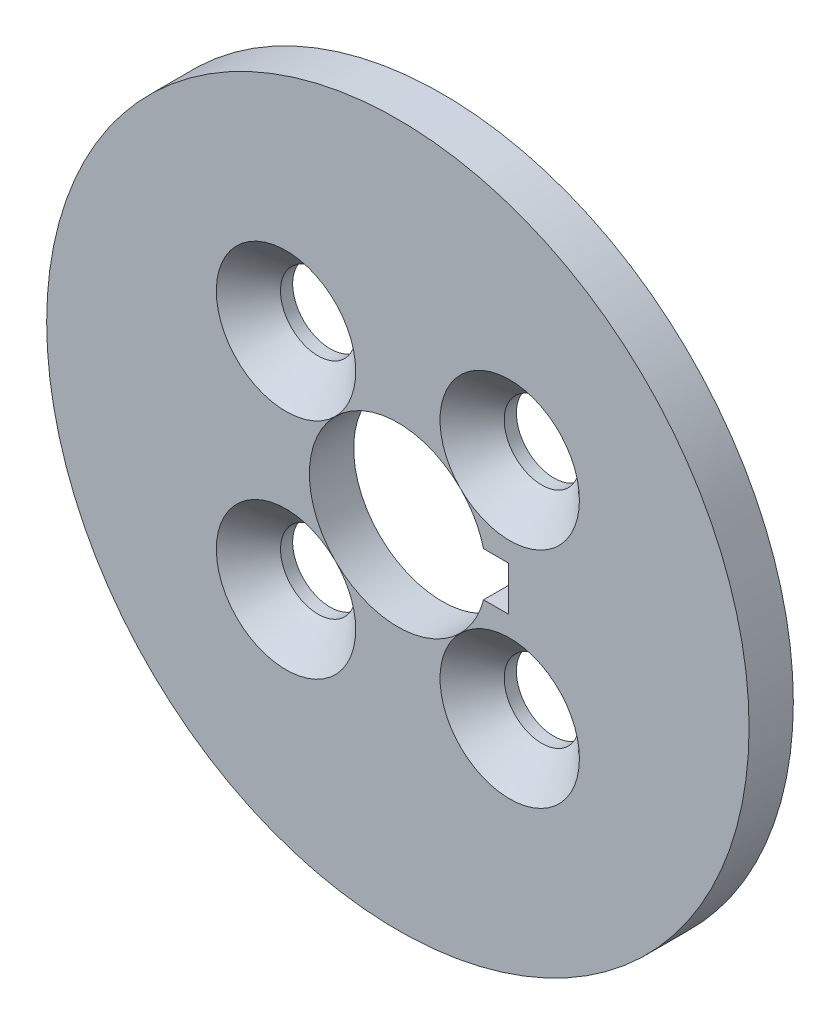
ISO-10303-21;
HEADER;
FILE_DESCRIPTION(('STEP AP214'),'2;1');
FILE_NAME('part.step','',(''),(''),'','','');
FILE_SCHEMA(('AUTOMOTIVE_DESIGN { 1 0 10303 214 1 1 1 1 }'));
ENDSEC;
DATA;
#1=APPLICATION_CONTEXT('core data for automotive mechanical design processes');
#2=APPLICATION_PROTOCOL_DEFINITION('international standard','automotive_design',2000,#1);
#3=PRODUCT_CONTEXT('',#1,'mechanical');
#4=PRODUCT('Part','Part','',(#3));
#5=PRODUCT_RELATED_PRODUCT_CATEGORY('part','',(#4));
#6=PRODUCT_DEFINITION_FORMATION('','',#4);
#7=PRODUCT_DEFINITION_CONTEXT('part definition',#1,'design');
#8=PRODUCT_DEFINITION('design','',#6,#7);
#9=PRODUCT_DEFINITION_SHAPE('','',#8);
#10=(LENGTH_UNIT() NAMED_UNIT(*) SI_UNIT(.MILLI.,.METRE.));
#11=(NAMED_UNIT(*) PLANE_ANGLE_UNIT() SI_UNIT($,.RADIAN.));
#12=(NAMED_UNIT(*) SI_UNIT($,.STERADIAN.) SOLID_ANGLE_UNIT());
#13=UNCERTAINTY_MEASURE_WITH_UNIT(LENGTH_MEASURE(1.E-05),#10,'distance_accuracy_value','');
#14=(GEOMETRIC_REPRESENTATION_CONTEXT(3) GLOBAL_UNCERTAINTY_ASSIGNED_CONTEXT((#13)) GLOBAL_UNIT_ASSIGNED_CONTEXT((#10,
#11,#12)) REPRESENTATION_CONTEXT('',''));
#15=CARTESIAN_POINT('',(0.,0.,0.));
#16=DIRECTION('',(0.,0.,1.));
#17=DIRECTION('',(1.,0.,0.));
#18=AXIS2_PLACEMENT_3D('',#15,#16,#17);
#19=CARTESIAN_POINT('',(-165.662570111801,103.941444968287,2.));
#20=DIRECTION('',(0.,0.,-1.));
#21=DIRECTION('',(-1.,0.,0.));
#22=AXIS2_PLACEMENT_3D('',#19,#20,#21);
#23=CYLINDRICAL_SURFACE('',#22,1.70000000000001);
#24=CARTESIAN_POINT('',(-165.662570111801,103.941444968287,0.));
#25=DIRECTION('',(0.,0.,1.));
#26=DIRECTION('',(1.,0.,0.));
#27=AXIS2_PLACEMENT_3D('',#24,#25,#26);
#28=CIRCLE('',#27,1.70000000000001);
#29=CARTESIAN_POINT('',(-163.962570111801,103.941444968287,0.));
#30=VERTEX_POINT('',#29);
#31=EDGE_CURVE('E154',#30,#30,#28,.T.);
#32=ORIENTED_EDGE('',*,*,#31,.F.);
#33=EDGE_LOOP('',(#32));
#34=FACE_BOUND('',#33,.T.);
#35=CARTESIAN_POINT('',(-165.662570111801,103.941444968287,0.549999999999993));
#36=DIRECTION('',(0.,0.,1.));
#37=DIRECTION('',(1.,0.,0.));
#38=AXIS2_PLACEMENT_3D('',#35,#36,#37);
#39=CIRCLE('',#38,1.69999999999998);
#40=CARTESIAN_POINT('',(-163.962570111801,103.941444968287,0.549999999999993));
#41=VERTEX_POINT('',#40);
#42=EDGE_CURVE('E116',#41,#41,#39,.T.);
#43=ORIENTED_EDGE('',*,*,#42,.T.);
#44=EDGE_LOOP('',(#43));
#45=FACE_BOUND('',#44,.T.);
#46=ADVANCED_FACE('F34',(#34,#45),#23,.F.);
#47=CARTESIAN_POINT('',(-155.550943140833,103.941444968288,2.));
#48=DIRECTION('',(0.,0.,-1.));
#49=DIRECTION('',(-1.,0.,0.));
#50=AXIS2_PLACEMENT_3D('',#47,#48,#49);
#51=CYLINDRICAL_SURFACE('',#50,1.70000000000001);
#52=CARTESIAN_POINT('',(-155.550943140833,103.941444968288,0.));
#53=DIRECTION('',(0.,0.,1.));
#54=DIRECTION('',(1.,0.,0.));
#55=AXIS2_PLACEMENT_3D('',#52,#53,#54);
#56=CIRCLE('',#55,1.70000000000001);
#57=CARTESIAN_POINT('',(-153.850943140833,103.941444968288,0.));
#58=VERTEX_POINT('',#57);
#59=EDGE_CURVE('E146',#58,#58,#56,.T.);
#60=ORIENTED_EDGE('',*,*,#59,.F.);
#61=EDGE_LOOP('',(#60));
#62=FACE_BOUND('',#61,.T.);
#63=CARTESIAN_POINT('',(-155.550943140833,103.941444968288,0.549999999999993));
#64=DIRECTION('',(0.,0.,1.));
#65=DIRECTION('',(1.,0.,0.));
#66=AXIS2_PLACEMENT_3D('',#63,#64,#65);
#67=CIRCLE('',#66,1.69999999999998);
#68=CARTESIAN_POINT('',(-153.850943140833,103.941444968288,0.549999999999993));
#69=VERTEX_POINT('',#68);
#70=EDGE_CURVE('E122',#69,#69,#67,.T.);
#71=ORIENTED_EDGE('',*,*,#70,.T.);
#72=EDGE_LOOP('',(#71));
#73=FACE_BOUND('',#72,.T.);
#74=ADVANCED_FACE('F218',(#62,#73),#51,.F.);
#75=CARTESIAN_POINT('',(-155.550943140833,93.82981799732,2.));
#76=DIRECTION('',(0.,0.,-1.));
#77=DIRECTION('',(-1.,0.,0.));
#78=AXIS2_PLACEMENT_3D('',#75,#76,#77);
#79=CYLINDRICAL_SURFACE('',#78,1.70000000000001);
#80=CARTESIAN_POINT('',(-155.550943140833,93.82981799732,0.));
#81=DIRECTION('',(0.,0.,1.));
#82=DIRECTION('',(1.,0.,0.));
#83=AXIS2_PLACEMENT_3D('',#80,#81,#82);
#84=CIRCLE('',#83,1.70000000000001);
#85=CARTESIAN_POINT('',(-153.850943140833,93.82981799732,0.));
#86=VERTEX_POINT('',#85);
#87=EDGE_CURVE('E139',#86,#86,#84,.T.);
#88=ORIENTED_EDGE('',*,*,#87,.F.);
#89=EDGE_LOOP('',(#88));
#90=FACE_BOUND('',#89,.T.);
#91=CARTESIAN_POINT('',(-155.550943140833,93.82981799732,0.549999999999993));
#92=DIRECTION('',(0.,0.,1.));
#93=DIRECTION('',(1.,0.,0.));
#94=AXIS2_PLACEMENT_3D('',#91,#92,#93);
#95=CIRCLE('',#94,1.69999999999998);
#96=CARTESIAN_POINT('',(-153.850943140833,93.82981799732,0.549999999999993));
#97=VERTEX_POINT('',#96);
#98=EDGE_CURVE('E127',#97,#97,#95,.T.);
#99=ORIENTED_EDGE('',*,*,#98,.T.);
#100=EDGE_LOOP('',(#99));
#101=FACE_BOUND('',#100,.T.);
#102=ADVANCED_FACE('F181',(#90,#101),#79,.F.);
#103=CARTESIAN_POINT('',(-165.6625701118,93.8298179973198,2.));
#104=DIRECTION('',(0.,0.,-1.));
#105=DIRECTION('',(-1.,0.,0.));
#106=AXIS2_PLACEMENT_3D('',#103,#104,#105);
#107=CYLINDRICAL_SURFACE('',#106,1.70000000000001);
#108=CARTESIAN_POINT('',(-165.6625701118,93.8298179973198,0.));
#109=DIRECTION('',(0.,0.,1.));
#110=DIRECTION('',(1.,0.,0.));
#111=AXIS2_PLACEMENT_3D('',#108,#109,#110);
#112=CIRCLE('',#111,1.70000000000001);
#113=CARTESIAN_POINT('',(-163.9625701118,93.8298179973198,0.));
#114=VERTEX_POINT('',#113);
#115=EDGE_CURVE('E136',#114,#114,#112,.T.);
#116=ORIENTED_EDGE('',*,*,#115,.F.);
#117=EDGE_LOOP('',(#116));
#118=FACE_BOUND('',#117,.T.);
#119=CARTESIAN_POINT('',(-165.6625701118,93.8298179973198,0.549999999999993));
#120=DIRECTION('',(0.,0.,1.));
#121=DIRECTION('',(1.,0.,0.));
#122=AXIS2_PLACEMENT_3D('',#119,#120,#121);
#123=CIRCLE('',#122,1.69999999999998);
#124=CARTESIAN_POINT('',(-163.9625701118,93.8298179973198,0.549999999999993));
#125=VERTEX_POINT('',#124);
#126=EDGE_CURVE('E133',#125,#125,#123,.T.);
#127=ORIENTED_EDGE('',*,*,#126,.T.);
#128=EDGE_LOOP('',(#127));
#129=FACE_BOUND('',#128,.T.);
#130=ADVANCED_FACE('F178',(#118,#129),#107,.F.);
#131=CARTESIAN_POINT('',(-160.606756626317,98.8856314828036,2.));
#132=DIRECTION('',(0.,0.,1.));
#133=DIRECTION('',(1.,0.,0.));
#134=AXIS2_PLACEMENT_3D('',#131,#132,#133);
#135=PLANE('',#134);
#136=DIRECTION('',(1.,0.,0.));
#137=VECTOR('',#136,1.);
#138=CARTESIAN_POINT('',(-155.606756626313,99.8856314828065,2.));
#139=LINE('',#138,#137);
#140=CARTESIAN_POINT('',(-156.73377328011,99.8856314828065,2.));
#141=VERTEX_POINT('',#140);
#142=CARTESIAN_POINT('',(-155.606756626313,99.8856314828065,2.));
#143=VERTEX_POINT('',#142);
#144=EDGE_CURVE('E95',#141,#143,#139,.T.);
#145=ORIENTED_EDGE('',*,*,#144,.T.);
#146=DIRECTION('',(1.94289029309404E-13,-1.,0.));
#147=VECTOR('',#146,1.);
#148=CARTESIAN_POINT('',(-155.606756626313,99.8856314828065,2.));
#149=LINE('',#148,#147);
#150=CARTESIAN_POINT('',(-155.606756626313,97.8856314828065,2.));
#151=VERTEX_POINT('',#150);
#152=EDGE_CURVE('E90',#143,#151,#149,.T.);
#153=ORIENTED_EDGE('',*,*,#152,.T.);
#154=DIRECTION('',(-1.,0.,0.));
#155=VECTOR('',#154,1.);
#156=CARTESIAN_POINT('',(-155.606756626313,97.8856314828065,2.));
#157=LINE('',#156,#155);
#158=CARTESIAN_POINT('',(-156.733773280109,97.8856314828065,2.));
#159=VERTEX_POINT('',#158);
#160=EDGE_CURVE('E98',#151,#159,#157,.T.);
#161=ORIENTED_EDGE('',*,*,#160,.T.);
#162=CARTESIAN_POINT('',(-160.606756626317,98.8856314828036,2.));
#163=DIRECTION('',(0.,0.,1.));
#164=DIRECTION('',(1.,0.,0.));
#165=AXIS2_PLACEMENT_3D('',#162,#163,#164);
#166=CIRCLE('',#165,3.99999999999999);
#167=CARTESIAN_POINT('',(-157.778329501571,96.0572043580566,2.));
#168=VERTEX_POINT('',#167);
#169=EDGE_CURVE('E147',#168,#159,#166,.T.);
#170=ORIENTED_EDGE('',*,*,#169,.F.);
#171=CARTESIAN_POINT('',(-155.550943140833,93.82981799732,2.));
#172=DIRECTION('',(0.,0.,1.));
#173=DIRECTION('',(1.,0.,0.));
#174=AXIS2_PLACEMENT_3D('',#171,#172,#173);
#175=CIRCLE('',#174,3.15000000000001);
#176=EDGE_CURVE('E125',#168,#168,#175,.T.);
#177=ORIENTED_EDGE('',*,*,#176,.F.);
#178=CARTESIAN_POINT('',(-163.435183751064,96.0572043580586,2.));
#179=VERTEX_POINT('',#178);
#180=EDGE_CURVE('E143',#179,#168,#166,.T.);
#181=ORIENTED_EDGE('',*,*,#180,.F.);
#182=CARTESIAN_POINT('',(-165.6625701118,93.8298179973198,2.));
#183=DIRECTION('',(0.,0.,1.));
#184=DIRECTION('',(1.,0.,0.));
#185=AXIS2_PLACEMENT_3D('',#182,#183,#184);
#186=CIRCLE('',#185,3.14999999999999);
#187=EDGE_CURVE('E130',#179,#179,#186,.T.);
#188=ORIENTED_EDGE('',*,*,#187,.F.);
#189=CARTESIAN_POINT('',(-163.435183751065,101.714058607548,2.));
#190=VERTEX_POINT('',#189);
#191=EDGE_CURVE('E151',#190,#179,#166,.T.);
#192=ORIENTED_EDGE('',*,*,#191,.F.);
#193=CARTESIAN_POINT('',(-165.662570111801,103.941444968287,2.));
#194=DIRECTION('',(0.,0.,1.));
#195=DIRECTION('',(1.,0.,0.));
#196=AXIS2_PLACEMENT_3D('',#193,#194,#195);
#197=CIRCLE('',#196,3.15000000000001);
#198=EDGE_CURVE('E55',#190,#190,#197,.T.);
#199=ORIENTED_EDGE('',*,*,#198,.F.);
#200=CARTESIAN_POINT('',(-157.77832950157,101.714058607549,2.));
#201=VERTEX_POINT('',#200);
#202=EDGE_CURVE('E199',#201,#190,#166,.T.);
#203=ORIENTED_EDGE('',*,*,#202,.F.);
#204=CARTESIAN_POINT('',(-155.550943140833,103.941444968288,2.));
#205=DIRECTION('',(0.,0.,1.));
#206=DIRECTION('',(1.,0.,0.));
#207=AXIS2_PLACEMENT_3D('',#204,#205,#206);
#208=CIRCLE('',#207,3.15000000000001);
#209=EDGE_CURVE('E119',#201,#201,#208,.T.);
#210=ORIENTED_EDGE('',*,*,#209,.F.);
#211=EDGE_CURVE('E148',#141,#201,#166,.T.);
#212=ORIENTED_EDGE('',*,*,#211,.F.);
#213=EDGE_LOOP('',(#145,#153,#161,#170,#177,#181,#188,#192,#199,#203,#210,#212));
#214=FACE_BOUND('',#213,.T.);
#215=CARTESIAN_POINT('',(-160.606756626317,98.8856314828036,2.));
#216=DIRECTION('',(0.,0.,1.));
#217=DIRECTION('',(1.,0.,0.));
#218=AXIS2_PLACEMENT_3D('',#215,#216,#217);
#219=CIRCLE('',#218,15.875);
#220=CARTESIAN_POINT('',(-144.731756626317,98.8856314828036,2.));
#221=VERTEX_POINT('',#220);
#222=EDGE_CURVE('E158',#221,#221,#219,.T.);
#223=ORIENTED_EDGE('',*,*,#222,.T.);
#224=EDGE_LOOP('',(#223));
#225=FACE_BOUND('',#224,.T.);
#226=ADVANCED_FACE('F104',(#214,#225),#135,.T.);
#227=CARTESIAN_POINT('',(-160.606756626317,98.8856314828036,0.));
#228=DIRECTION('',(0.,0.,1.));
#229=DIRECTION('',(1.,0.,0.));
#230=AXIS2_PLACEMENT_3D('',#227,#228,#229);
#231=PLANE('',#230);
#232=CARTESIAN_POINT('',(-160.606756626317,98.8856314828036,0.));
#233=DIRECTION('',(0.,0.,1.));
#234=DIRECTION('',(1.,0.,0.));
#235=AXIS2_PLACEMENT_3D('',#232,#233,#234);
#236=CIRCLE('',#235,15.875);
#237=CARTESIAN_POINT('',(-144.731756626317,98.8856314828036,0.));
#238=VERTEX_POINT('',#237);
#239=EDGE_CURVE('E157',#238,#238,#236,.T.);
#240=ORIENTED_EDGE('',*,*,#239,.F.);
#241=EDGE_LOOP('',(#240));
#242=FACE_BOUND('',#241,.T.);
#243=ORIENTED_EDGE('',*,*,#31,.T.);
#244=EDGE_LOOP('',(#243));
#245=FACE_BOUND('',#244,.T.);
#246=ORIENTED_EDGE('',*,*,#59,.T.);
#247=EDGE_LOOP('',(#246));
#248=FACE_BOUND('',#247,.T.);
#249=DIRECTION('',(1.94289029309404E-13,-1.,0.));
#250=VECTOR('',#249,1.);
#251=CARTESIAN_POINT('',(-155.606756626313,99.8856314828065,0.));
#252=LINE('',#251,#250);
#253=CARTESIAN_POINT('',(-155.606756626313,99.8856314828065,0.));
#254=VERTEX_POINT('',#253);
#255=CARTESIAN_POINT('',(-155.606756626313,97.8856314828065,0.));
#256=VERTEX_POINT('',#255);
#257=EDGE_CURVE('E93',#254,#256,#252,.T.);
#258=ORIENTED_EDGE('',*,*,#257,.F.);
#259=DIRECTION('',(1.,0.,0.));
#260=VECTOR('',#259,1.);
#261=CARTESIAN_POINT('',(-155.606756626313,99.8856314828065,0.));
#262=LINE('',#261,#260);
#263=CARTESIAN_POINT('',(-156.73377328011,99.8856314828065,0.));
#264=VERTEX_POINT('',#263);
#265=EDGE_CURVE('E107',#264,#254,#262,.T.);
#266=ORIENTED_EDGE('',*,*,#265,.F.);
#267=CARTESIAN_POINT('',(-160.606756626317,98.8856314828036,0.));
#268=DIRECTION('',(0.,0.,1.));
#269=DIRECTION('',(1.,0.,0.));
#270=AXIS2_PLACEMENT_3D('',#267,#268,#269);
#271=CIRCLE('',#270,3.99999999999999);
#272=CARTESIAN_POINT('',(-156.733773280109,97.8856314828065,0.));
#273=VERTEX_POINT('',#272);
#274=EDGE_CURVE('E142',#264,#273,#271,.T.);
#275=ORIENTED_EDGE('',*,*,#274,.T.);
#276=DIRECTION('',(-1.,0.,0.));
#277=VECTOR('',#276,1.);
#278=CARTESIAN_POINT('',(-155.606756626313,97.8856314828065,0.));
#279=LINE('',#278,#277);
#280=EDGE_CURVE('E49',#256,#273,#279,.T.);
#281=ORIENTED_EDGE('',*,*,#280,.F.);
#282=EDGE_LOOP('',(#258,#266,#275,#281));
#283=FACE_BOUND('',#282,.T.);
#284=ORIENTED_EDGE('',*,*,#87,.T.);
#285=EDGE_LOOP('',(#284));
#286=FACE_BOUND('',#285,.T.);
#287=ORIENTED_EDGE('',*,*,#115,.T.);
#288=EDGE_LOOP('',(#287));
#289=FACE_BOUND('',#288,.T.);
#290=ADVANCED_FACE('F165',(#242,#245,#248,#283,#286,#289),#231,.F.);
#291=CARTESIAN_POINT('',(-160.606756626317,98.8856314828036,2.));
#292=DIRECTION('',(0.,0.,-1.));
#293=DIRECTION('',(-1.,0.,0.));
#294=AXIS2_PLACEMENT_3D('',#291,#292,#293);
#295=CYLINDRICAL_SURFACE('',#294,15.875);
#296=ORIENTED_EDGE('',*,*,#222,.F.);
#297=EDGE_LOOP('',(#296));
#298=FACE_BOUND('',#297,.T.);
#299=ORIENTED_EDGE('',*,*,#239,.T.);
#300=EDGE_LOOP('',(#299));
#301=FACE_BOUND('',#300,.T.);
#302=ADVANCED_FACE('F36',(#298,#301),#295,.T.);
#303=CARTESIAN_POINT('',(-160.606756626317,98.8856314828036,2.));
#304=DIRECTION('',(0.,0.,-1.));
#305=DIRECTION('',(-1.,0.,0.));
#306=AXIS2_PLACEMENT_3D('',#303,#304,#305);
#307=CYLINDRICAL_SURFACE('',#306,3.99999999999999);
#308=DIRECTION('',(0.,0.,-1.));
#309=VECTOR('',#308,1.);
#310=CARTESIAN_POINT('',(-156.73377328011,99.8856314828065,2.));
#311=LINE('',#310,#309);
#312=EDGE_CURVE('E11',#141,#264,#311,.T.);
#313=ORIENTED_EDGE('',*,*,#312,.F.);
#314=ORIENTED_EDGE('',*,*,#211,.T.);
#315=ORIENTED_EDGE('',*,*,#202,.T.);
#316=ORIENTED_EDGE('',*,*,#191,.T.);
#317=ORIENTED_EDGE('',*,*,#180,.T.);
#318=ORIENTED_EDGE('',*,*,#169,.T.);
#319=DIRECTION('',(0.,0.,-1.));
#320=VECTOR('',#319,1.);
#321=CARTESIAN_POINT('',(-156.733773280109,97.8856314828065,2.));
#322=LINE('',#321,#320);
#323=EDGE_CURVE('E42',#273,#159,#322,.F.);
#324=ORIENTED_EDGE('',*,*,#323,.F.);
#325=ORIENTED_EDGE('',*,*,#274,.F.);
#326=EDGE_LOOP('',(#313,#314,#315,#316,#317,#318,#324,#325));
#327=FACE_BOUND('',#326,.T.);
#328=ADVANCED_FACE('F189',(#327),#307,.F.);
#329=CARTESIAN_POINT('',(-165.6625701118,93.8298179973198,2.));
#330=DIRECTION('',(0.,0.,1.));
#331=DIRECTION('',(1.,0.,0.));
#332=AXIS2_PLACEMENT_3D('',#329,#330,#331);
#333=CONICAL_SURFACE('',#332,3.14999999999999,0.785398163397448);
#334=ORIENTED_EDGE('',*,*,#126,.F.);
#335=EDGE_LOOP('',(#334));
#336=FACE_BOUND('',#335,.T.);
#337=ORIENTED_EDGE('',*,*,#187,.T.);
#338=EDGE_LOOP('',(#337));
#339=FACE_BOUND('',#338,.T.);
#340=ADVANCED_FACE('F185',(#336,#339),#333,.F.);
#341=CARTESIAN_POINT('',(-155.550943140833,93.82981799732,2.));
#342=DIRECTION('',(0.,0.,1.));
#343=DIRECTION('',(1.,0.,0.));
#344=AXIS2_PLACEMENT_3D('',#341,#342,#343);
#345=CONICAL_SURFACE('',#344,3.15000000000001,0.785398163397457);
#346=ORIENTED_EDGE('',*,*,#98,.F.);
#347=EDGE_LOOP('',(#346));
#348=FACE_BOUND('',#347,.T.);
#349=ORIENTED_EDGE('',*,*,#176,.T.);
#350=EDGE_LOOP('',(#349));
#351=FACE_BOUND('',#350,.T.);
#352=ADVANCED_FACE('F188',(#348,#351),#345,.F.);
#353=CARTESIAN_POINT('',(-155.550943140833,103.941444968288,2.));
#354=DIRECTION('',(0.,0.,1.));
#355=DIRECTION('',(1.,0.,0.));
#356=AXIS2_PLACEMENT_3D('',#353,#354,#355);
#357=CONICAL_SURFACE('',#356,3.15000000000001,0.785398163397457);
#358=ORIENTED_EDGE('',*,*,#70,.F.);
#359=EDGE_LOOP('',(#358));
#360=FACE_BOUND('',#359,.T.);
#361=ORIENTED_EDGE('',*,*,#209,.T.);
#362=EDGE_LOOP('',(#361));
#363=FACE_BOUND('',#362,.T.);
#364=ADVANCED_FACE('F203',(#360,#363),#357,.F.);
#365=CARTESIAN_POINT('',(-165.662570111801,103.941444968287,2.));
#366=DIRECTION('',(0.,0.,1.));
#367=DIRECTION('',(1.,0.,0.));
#368=AXIS2_PLACEMENT_3D('',#365,#366,#367);
#369=CONICAL_SURFACE('',#368,3.15000000000001,0.785398163397457);
#370=ORIENTED_EDGE('',*,*,#42,.F.);
#371=EDGE_LOOP('',(#370));
#372=FACE_BOUND('',#371,.T.);
#373=ORIENTED_EDGE('',*,*,#198,.T.);
#374=EDGE_LOOP('',(#373));
#375=FACE_BOUND('',#374,.T.);
#376=ADVANCED_FACE('F205',(#372,#375),#369,.F.);
#377=CARTESIAN_POINT('',(-155.606756626313,99.8856314828065,2.));
#378=DIRECTION('',(1.,1.94289029309404E-13,0.));
#379=DIRECTION('',(-1.94289029309404E-13,1.,0.));
#380=AXIS2_PLACEMENT_3D('',#377,#378,#379);
#381=PLANE('',#380);
#382=ORIENTED_EDGE('',*,*,#257,.T.);
#383=DIRECTION('',(0.,0.,-1.));
#384=VECTOR('',#383,1.);
#385=CARTESIAN_POINT('',(-155.606756626313,97.8856314828065,2.));
#386=LINE('',#385,#384);
#387=EDGE_CURVE('E85',#151,#256,#386,.T.);
#388=ORIENTED_EDGE('',*,*,#387,.F.);
#389=ORIENTED_EDGE('',*,*,#152,.F.);
#390=DIRECTION('',(0.,0.,-1.));
#391=VECTOR('',#390,1.);
#392=CARTESIAN_POINT('',(-155.606756626313,99.8856314828065,2.));
#393=LINE('',#392,#391);
#394=EDGE_CURVE('E94',#143,#254,#393,.T.);
#395=ORIENTED_EDGE('',*,*,#394,.T.);
#396=EDGE_LOOP('',(#382,#388,#389,#395));
#397=FACE_BOUND('',#396,.T.);
#398=ADVANCED_FACE('F87',(#397),#381,.F.);
#399=CARTESIAN_POINT('',(-155.606756626313,99.8856314828065,2.));
#400=DIRECTION('',(0.,1.,0.));
#401=DIRECTION('',(0.,0.,1.));
#402=AXIS2_PLACEMENT_3D('',#399,#400,#401);
#403=PLANE('',#402);
#404=ORIENTED_EDGE('',*,*,#312,.T.);
#405=ORIENTED_EDGE('',*,*,#265,.T.);
#406=ORIENTED_EDGE('',*,*,#394,.F.);
#407=ORIENTED_EDGE('',*,*,#144,.F.);
#408=EDGE_LOOP('',(#404,#405,#406,#407));
#409=FACE_BOUND('',#408,.T.);
#410=ADVANCED_FACE('F277',(#409),#403,.F.);
#411=CARTESIAN_POINT('',(-155.606756626313,97.8856314828065,2.));
#412=DIRECTION('',(0.,-1.,0.));
#413=DIRECTION('',(0.,0.,-1.));
#414=AXIS2_PLACEMENT_3D('',#411,#412,#413);
#415=PLANE('',#414);
#416=ORIENTED_EDGE('',*,*,#323,.T.);
#417=ORIENTED_EDGE('',*,*,#160,.F.);
#418=ORIENTED_EDGE('',*,*,#387,.T.);
#419=ORIENTED_EDGE('',*,*,#280,.T.);
#420=EDGE_LOOP('',(#416,#417,#418,#419));
#421=FACE_BOUND('',#420,.T.);
#422=ADVANCED_FACE('F99',(#421),#415,.F.);
#423=CLOSED_SHELL('',(#46,#74,#102,#130,#226,#290,#302,#328,#340,#352,#364,#376,#398,#410,#422));
#424=MANIFOLD_SOLID_BREP('B2',#423);
#425=ADVANCED_BREP_SHAPE_REPRESENTATION('',(#18,#424),#14);
#426=SHAPE_DEFINITION_REPRESENTATION(#9,#425);
ENDSEC;
END-ISO-10303-21;
